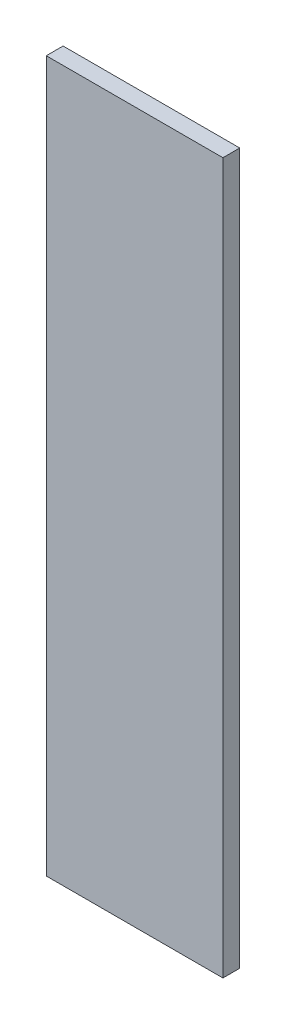
ISO-10303-21;
HEADER;
FILE_DESCRIPTION(('STEP AP214'),'2;1');
FILE_NAME('part.step','',(''),(''),'','','');
FILE_SCHEMA(('AUTOMOTIVE_DESIGN { 1 0 10303 214 1 1 1 1 }'));
ENDSEC;
DATA;
#1=APPLICATION_CONTEXT('core data for automotive mechanical design processes');
#2=APPLICATION_PROTOCOL_DEFINITION('international standard','automotive_design',2000,#1);
#3=PRODUCT_CONTEXT('',#1,'mechanical');
#4=PRODUCT('Part','Part','',(#3));
#5=PRODUCT_RELATED_PRODUCT_CATEGORY('part','',(#4));
#6=PRODUCT_DEFINITION_FORMATION('','',#4);
#7=PRODUCT_DEFINITION_CONTEXT('part definition',#1,'design');
#8=PRODUCT_DEFINITION('design','',#6,#7);
#9=PRODUCT_DEFINITION_SHAPE('','',#8);
#10=(LENGTH_UNIT() NAMED_UNIT(*) SI_UNIT(.MILLI.,.METRE.));
#11=(NAMED_UNIT(*) PLANE_ANGLE_UNIT() SI_UNIT($,.RADIAN.));
#12=(NAMED_UNIT(*) SI_UNIT($,.STERADIAN.) SOLID_ANGLE_UNIT());
#13=UNCERTAINTY_MEASURE_WITH_UNIT(LENGTH_MEASURE(1.E-05),#10,'distance_accuracy_value','');
#14=(GEOMETRIC_REPRESENTATION_CONTEXT(3) GLOBAL_UNCERTAINTY_ASSIGNED_CONTEXT((#13)) GLOBAL_UNIT_ASSIGNED_CONTEXT((#10,
#11,#12)) REPRESENTATION_CONTEXT('',''));
#15=CARTESIAN_POINT('',(0.,0.,0.));
#16=DIRECTION('',(0.,0.,1.));
#17=DIRECTION('',(1.,0.,0.));
#18=AXIS2_PLACEMENT_3D('',#15,#16,#17);
#19=CARTESIAN_POINT('',(-94.5,-380.,18.));
#20=DIRECTION('',(1.,0.,0.));
#21=DIRECTION('',(0.,0.,-1.));
#22=AXIS2_PLACEMENT_3D('',#19,#20,#21);
#23=PLANE('',#22);
#24=DIRECTION('',(0.,-1.,0.));
#25=VECTOR('',#24,1.);
#26=CARTESIAN_POINT('',(-94.5,-380.,0.));
#27=LINE('',#26,#25);
#28=CARTESIAN_POINT('',(-94.5,380.,0.));
#29=VERTEX_POINT('',#28);
#30=CARTESIAN_POINT('',(-94.5,-380.,0.));
#31=VERTEX_POINT('',#30);
#32=EDGE_CURVE('E96',#29,#31,#27,.T.);
#33=ORIENTED_EDGE('',*,*,#32,.T.);
#34=DIRECTION('',(0.,0.,-1.));
#35=VECTOR('',#34,1.);
#36=CARTESIAN_POINT('',(-94.5,-380.,18.));
#37=LINE('',#36,#35);
#38=CARTESIAN_POINT('',(-94.5,-380.,18.));
#39=VERTEX_POINT('',#38);
#40=EDGE_CURVE('E11',#39,#31,#37,.T.);
#41=ORIENTED_EDGE('',*,*,#40,.F.);
#42=DIRECTION('',(0.,-1.,0.));
#43=VECTOR('',#42,1.);
#44=CARTESIAN_POINT('',(-94.5,-380.,18.));
#45=LINE('',#44,#43);
#46=CARTESIAN_POINT('',(-94.5,380.,18.));
#47=VERTEX_POINT('',#46);
#48=EDGE_CURVE('E84',#47,#39,#45,.T.);
#49=ORIENTED_EDGE('',*,*,#48,.F.);
#50=DIRECTION('',(0.,0.,-1.));
#51=VECTOR('',#50,1.);
#52=CARTESIAN_POINT('',(-94.5,380.,18.));
#53=LINE('',#52,#51);
#54=EDGE_CURVE('E92',#47,#29,#53,.T.);
#55=ORIENTED_EDGE('',*,*,#54,.T.);
#56=EDGE_LOOP('',(#33,#41,#49,#55));
#57=FACE_BOUND('',#56,.T.);
#58=ADVANCED_FACE('F33',(#57),#23,.F.);
#59=CARTESIAN_POINT('',(94.5,-380.,18.));
#60=DIRECTION('',(0.,1.,0.));
#61=DIRECTION('',(0.,0.,1.));
#62=AXIS2_PLACEMENT_3D('',#59,#60,#61);
#63=PLANE('',#62);
#64=DIRECTION('',(1.,0.,0.));
#65=VECTOR('',#64,1.);
#66=CARTESIAN_POINT('',(94.5,-380.,0.));
#67=LINE('',#66,#65);
#68=CARTESIAN_POINT('',(94.5,-380.,0.));
#69=VERTEX_POINT('',#68);
#70=EDGE_CURVE('E88',#31,#69,#67,.T.);
#71=ORIENTED_EDGE('',*,*,#70,.T.);
#72=DIRECTION('',(0.,0.,-1.));
#73=VECTOR('',#72,1.);
#74=CARTESIAN_POINT('',(94.5,-380.,18.));
#75=LINE('',#74,#73);
#76=CARTESIAN_POINT('',(94.5,-380.,18.));
#77=VERTEX_POINT('',#76);
#78=EDGE_CURVE('E41',#77,#69,#75,.T.);
#79=ORIENTED_EDGE('',*,*,#78,.F.);
#80=DIRECTION('',(1.,0.,0.));
#81=VECTOR('',#80,1.);
#82=CARTESIAN_POINT('',(94.5,-380.,18.));
#83=LINE('',#82,#81);
#84=EDGE_CURVE('E79',#39,#77,#83,.T.);
#85=ORIENTED_EDGE('',*,*,#84,.F.);
#86=ORIENTED_EDGE('',*,*,#40,.T.);
#87=EDGE_LOOP('',(#71,#79,#85,#86));
#88=FACE_BOUND('',#87,.T.);
#89=ADVANCED_FACE('F87',(#88),#63,.F.);
#90=CARTESIAN_POINT('',(94.5,-380.,18.));
#91=DIRECTION('',(-1.,0.,0.));
#92=DIRECTION('',(0.,0.,1.));
#93=AXIS2_PLACEMENT_3D('',#90,#91,#92);
#94=PLANE('',#93);
#95=DIRECTION('',(0.,1.,0.));
#96=VECTOR('',#95,1.);
#97=CARTESIAN_POINT('',(94.5,-380.,0.));
#98=LINE('',#97,#96);
#99=CARTESIAN_POINT('',(94.5,380.,0.));
#100=VERTEX_POINT('',#99);
#101=EDGE_CURVE('E66',#69,#100,#98,.T.);
#102=ORIENTED_EDGE('',*,*,#101,.T.);
#103=DIRECTION('',(0.,0.,-1.));
#104=VECTOR('',#103,1.);
#105=CARTESIAN_POINT('',(94.5,380.,18.));
#106=LINE('',#105,#104);
#107=CARTESIAN_POINT('',(94.5,380.,18.));
#108=VERTEX_POINT('',#107);
#109=EDGE_CURVE('E89',#108,#100,#106,.T.);
#110=ORIENTED_EDGE('',*,*,#109,.F.);
#111=DIRECTION('',(0.,1.,0.));
#112=VECTOR('',#111,1.);
#113=CARTESIAN_POINT('',(94.5,-380.,18.));
#114=LINE('',#113,#112);
#115=EDGE_CURVE('E82',#77,#108,#114,.T.);
#116=ORIENTED_EDGE('',*,*,#115,.F.);
#117=ORIENTED_EDGE('',*,*,#78,.T.);
#118=EDGE_LOOP('',(#102,#110,#116,#117));
#119=FACE_BOUND('',#118,.T.);
#120=ADVANCED_FACE('F90',(#119),#94,.F.);
#121=CARTESIAN_POINT('',(94.5,380.,18.));
#122=DIRECTION('',(0.,-1.,0.));
#123=DIRECTION('',(0.,0.,-1.));
#124=AXIS2_PLACEMENT_3D('',#121,#122,#123);
#125=PLANE('',#124);
#126=DIRECTION('',(-1.,0.,0.));
#127=VECTOR('',#126,1.);
#128=CARTESIAN_POINT('',(94.5,380.,0.));
#129=LINE('',#128,#127);
#130=EDGE_CURVE('E72',#100,#29,#129,.T.);
#131=ORIENTED_EDGE('',*,*,#130,.T.);
#132=ORIENTED_EDGE('',*,*,#54,.F.);
#133=DIRECTION('',(-1.,0.,0.));
#134=VECTOR('',#133,1.);
#135=CARTESIAN_POINT('',(94.5,380.,18.));
#136=LINE('',#135,#134);
#137=EDGE_CURVE('E49',#108,#47,#136,.T.);
#138=ORIENTED_EDGE('',*,*,#137,.F.);
#139=ORIENTED_EDGE('',*,*,#109,.T.);
#140=EDGE_LOOP('',(#131,#132,#138,#139));
#141=FACE_BOUND('',#140,.T.);
#142=ADVANCED_FACE('F103',(#141),#125,.F.);
#143=CARTESIAN_POINT('',(0.,0.,18.));
#144=DIRECTION('',(0.,0.,1.));
#145=DIRECTION('',(1.,0.,0.));
#146=AXIS2_PLACEMENT_3D('',#143,#144,#145);
#147=PLANE('',#146);
#148=ORIENTED_EDGE('',*,*,#48,.T.);
#149=ORIENTED_EDGE('',*,*,#84,.T.);
#150=ORIENTED_EDGE('',*,*,#115,.T.);
#151=ORIENTED_EDGE('',*,*,#137,.T.);
#152=EDGE_LOOP('',(#148,#149,#150,#151));
#153=FACE_BOUND('',#152,.T.);
#154=ADVANCED_FACE('F80',(#153),#147,.T.);
#155=CARTESIAN_POINT('',(0.,0.,0.));
#156=DIRECTION('',(0.,0.,1.));
#157=DIRECTION('',(1.,0.,0.));
#158=AXIS2_PLACEMENT_3D('',#155,#156,#157);
#159=PLANE('',#158);
#160=ORIENTED_EDGE('',*,*,#32,.F.);
#161=ORIENTED_EDGE('',*,*,#130,.F.);
#162=ORIENTED_EDGE('',*,*,#101,.F.);
#163=ORIENTED_EDGE('',*,*,#70,.F.);
#164=EDGE_LOOP('',(#160,#161,#162,#163));
#165=FACE_BOUND('',#164,.T.);
#166=ADVANCED_FACE('F106',(#165),#159,.F.);
#167=CLOSED_SHELL('',(#58,#89,#120,#142,#154,#166));
#168=MANIFOLD_SOLID_BREP('B2',#167);
#169=ADVANCED_BREP_SHAPE_REPRESENTATION('',(#18,#168),#14);
#170=SHAPE_DEFINITION_REPRESENTATION(#9,#169);
ENDSEC;
END-ISO-10303-21;
